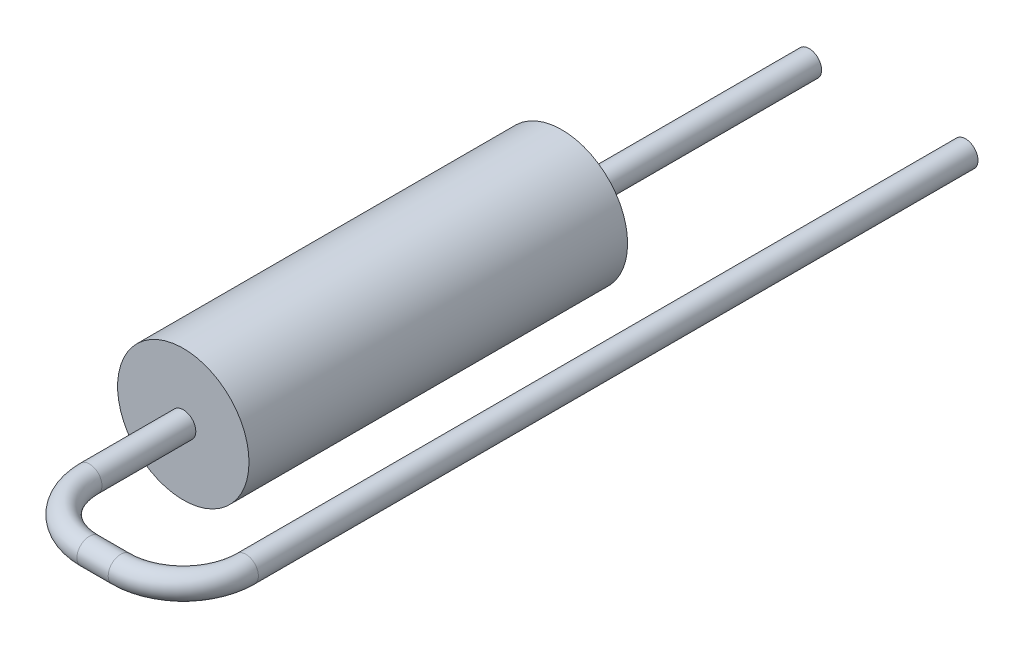
ISO-10303-21;
HEADER;
FILE_DESCRIPTION(('STEP AP214'),'2;1');
FILE_NAME('part.step','',(''),(''),'','','');
FILE_SCHEMA(('AUTOMOTIVE_DESIGN { 1 0 10303 214 1 1 1 1 }'));
ENDSEC;
DATA;
#1=APPLICATION_CONTEXT('core data for automotive mechanical design processes');
#2=APPLICATION_PROTOCOL_DEFINITION('international standard','automotive_design',2000,#1);
#3=PRODUCT_CONTEXT('',#1,'mechanical');
#4=PRODUCT('Part','Part','',(#3));
#5=PRODUCT_RELATED_PRODUCT_CATEGORY('part','',(#4));
#6=PRODUCT_DEFINITION_FORMATION('','',#4);
#7=PRODUCT_DEFINITION_CONTEXT('part definition',#1,'design');
#8=PRODUCT_DEFINITION('design','',#6,#7);
#9=PRODUCT_DEFINITION_SHAPE('','',#8);
#10=(LENGTH_UNIT() NAMED_UNIT(*) SI_UNIT(.MILLI.,.METRE.));
#11=(NAMED_UNIT(*) PLANE_ANGLE_UNIT() SI_UNIT($,.RADIAN.));
#12=(NAMED_UNIT(*) SI_UNIT($,.STERADIAN.) SOLID_ANGLE_UNIT());
#13=UNCERTAINTY_MEASURE_WITH_UNIT(LENGTH_MEASURE(1.E-05),#10,'distance_accuracy_value','');
#14=(GEOMETRIC_REPRESENTATION_CONTEXT(3) GLOBAL_UNCERTAINTY_ASSIGNED_CONTEXT((#13)) GLOBAL_UNIT_ASSIGNED_CONTEXT((#10,
#11,#12)) REPRESENTATION_CONTEXT('',''));
#15=CARTESIAN_POINT('',(0.,0.,0.));
#16=DIRECTION('',(0.,0.,1.));
#17=DIRECTION('',(1.,0.,0.));
#18=AXIS2_PLACEMENT_3D('',#15,#16,#17);
#19=CARTESIAN_POINT('',(0.,0.,0.));
#20=DIRECTION('',(0.,0.,1.));
#21=DIRECTION('',(1.,0.,0.));
#22=AXIS2_PLACEMENT_3D('',#19,#20,#21);
#23=PLANE('',#22);
#24=CARTESIAN_POINT('',(0.,0.,0.));
#25=DIRECTION('',(0.,0.,1.));
#26=DIRECTION('',(1.,0.,0.));
#27=AXIS2_PLACEMENT_3D('',#24,#25,#26);
#28=CIRCLE('',#27,2.1);
#29=CARTESIAN_POINT('',(2.1,0.,0.));
#30=VERTEX_POINT('',#29);
#31=EDGE_CURVE('E47',#30,#30,#28,.T.);
#32=ORIENTED_EDGE('',*,*,#31,.F.);
#33=EDGE_LOOP('',(#32));
#34=FACE_BOUND('',#33,.T.);
#35=CARTESIAN_POINT('',(0.,0.,0.));
#36=DIRECTION('',(0.,0.,1.));
#37=DIRECTION('',(1.,0.,0.));
#38=AXIS2_PLACEMENT_3D('',#35,#36,#37);
#39=CIRCLE('',#38,0.4);
#40=CARTESIAN_POINT('',(0.4,0.,0.));
#41=VERTEX_POINT('',#40);
#42=EDGE_CURVE('E10',#41,#41,#39,.F.);
#43=ORIENTED_EDGE('',*,*,#42,.F.);
#44=EDGE_LOOP('',(#43));
#45=FACE_BOUND('',#44,.T.);
#46=ADVANCED_FACE('F31',(#34,#45),#23,.F.);
#47=CARTESIAN_POINT('',(0.,0.,12.1));
#48=DIRECTION('',(0.,0.,-1.));
#49=DIRECTION('',(-1.,0.,0.));
#50=AXIS2_PLACEMENT_3D('',#47,#48,#49);
#51=CYLINDRICAL_SURFACE('',#50,2.1);
#52=CARTESIAN_POINT('',(0.,0.,12.1));
#53=DIRECTION('',(0.,0.,1.));
#54=DIRECTION('',(1.,0.,0.));
#55=AXIS2_PLACEMENT_3D('',#52,#53,#54);
#56=CIRCLE('',#55,2.1);
#57=CARTESIAN_POINT('',(2.1,0.,12.1));
#58=VERTEX_POINT('',#57);
#59=EDGE_CURVE('E42',#58,#58,#56,.T.);
#60=ORIENTED_EDGE('',*,*,#59,.F.);
#61=EDGE_LOOP('',(#60));
#62=FACE_BOUND('',#61,.T.);
#63=ORIENTED_EDGE('',*,*,#31,.T.);
#64=EDGE_LOOP('',(#63));
#65=FACE_BOUND('',#64,.T.);
#66=ADVANCED_FACE('F33',(#62,#65),#51,.T.);
#67=CARTESIAN_POINT('',(0.,0.,12.1));
#68=DIRECTION('',(0.,0.,1.));
#69=DIRECTION('',(1.,0.,0.));
#70=AXIS2_PLACEMENT_3D('',#67,#68,#69);
#71=PLANE('',#70);
#72=CARTESIAN_POINT('',(0.,0.,12.1));
#73=DIRECTION('',(0.,0.,1.));
#74=DIRECTION('',(1.,0.,0.));
#75=AXIS2_PLACEMENT_3D('',#72,#73,#74);
#76=CIRCLE('',#75,0.4);
#77=CARTESIAN_POINT('',(0.4,0.,12.1));
#78=VERTEX_POINT('',#77);
#79=EDGE_CURVE('E38',#78,#78,#76,.T.);
#80=ORIENTED_EDGE('',*,*,#79,.F.);
#81=EDGE_LOOP('',(#80));
#82=FACE_BOUND('',#81,.T.);
#83=ORIENTED_EDGE('',*,*,#59,.T.);
#84=EDGE_LOOP('',(#83));
#85=FACE_BOUND('',#84,.T.);
#86=ADVANCED_FACE('F73',(#82,#85),#71,.T.);
#87=CARTESIAN_POINT('',(5.,0.,15.1));
#88=DIRECTION('',(0.,0.,-1.));
#89=DIRECTION('',(-1.,0.,0.));
#90=AXIS2_PLACEMENT_3D('',#87,#88,#89);
#91=CYLINDRICAL_SURFACE('',#90,0.4);
#92=CARTESIAN_POINT('',(5.,0.,15.1));
#93=DIRECTION('',(0.,0.,-1.));
#94=DIRECTION('',(-1.,0.,0.));
#95=AXIS2_PLACEMENT_3D('',#92,#93,#94);
#96=CIRCLE('',#95,0.4);
#97=CARTESIAN_POINT('',(5.4,0.,15.1));
#98=VERTEX_POINT('',#97);
#99=EDGE_CURVE('E59',#98,#98,#96,.T.);
#100=ORIENTED_EDGE('',*,*,#99,.T.);
#101=EDGE_LOOP('',(#100));
#102=FACE_BOUND('',#101,.T.);
#103=CARTESIAN_POINT('',(5.,0.,-7.9));
#104=DIRECTION('',(0.,0.,-1.));
#105=DIRECTION('',(-1.,0.,0.));
#106=AXIS2_PLACEMENT_3D('',#103,#104,#105);
#107=CIRCLE('',#106,0.4);
#108=CARTESIAN_POINT('',(4.6,0.,-7.89999999999999));
#109=VERTEX_POINT('',#108);
#110=EDGE_CURVE('E62',#109,#109,#107,.T.);
#111=ORIENTED_EDGE('',*,*,#110,.F.);
#112=EDGE_LOOP('',(#111));
#113=FACE_BOUND('',#112,.T.);
#114=ADVANCED_FACE('F78',(#102,#113),#91,.T.);
#115=CARTESIAN_POINT('',(3.,0.,15.1));
#116=DIRECTION('',(0.,1.,0.));
#117=DIRECTION('',(0.,0.,1.));
#118=AXIS2_PLACEMENT_3D('',#115,#116,#117);
#119=TOROIDAL_SURFACE('',#118,2.,0.4);
#120=CARTESIAN_POINT('',(2.99999999999999,0.,17.1));
#121=DIRECTION('',(1.,0.,0.));
#122=DIRECTION('',(0.,0.,-1.));
#123=AXIS2_PLACEMENT_3D('',#120,#121,#122);
#124=CIRCLE('',#123,0.4);
#125=CARTESIAN_POINT('',(2.99999999999998,0.,17.5));
#126=VERTEX_POINT('',#125);
#127=EDGE_CURVE('E56',#126,#126,#124,.T.);
#128=CARTESIAN_POINT('',(3.,0.,15.1));
#129=DIRECTION('',(0.,1.,0.));
#130=DIRECTION('',(0.,0.,1.));
#131=AXIS2_PLACEMENT_3D('',#128,#129,#130);
#132=CIRCLE('',#131,2.4);
#133=EDGE_CURVE('',#126,#98,#132,.T.);
#134=ORIENTED_EDGE('',*,*,#127,.T.);
#135=ORIENTED_EDGE('',*,*,#99,.F.);
#136=ORIENTED_EDGE('',*,*,#133,.T.);
#137=ORIENTED_EDGE('',*,*,#133,.F.);
#138=EDGE_LOOP('',(#134,#136,#135,#137));
#139=FACE_BOUND('',#138,.T.);
#140=ADVANCED_FACE('F82',(#139),#119,.T.);
#141=CARTESIAN_POINT('',(2.00000000000001,0.,17.1));
#142=DIRECTION('',(1.,0.,0.));
#143=DIRECTION('',(0.,0.,-1.));
#144=AXIS2_PLACEMENT_3D('',#141,#142,#143);
#145=CYLINDRICAL_SURFACE('',#144,0.4);
#146=CARTESIAN_POINT('',(2.00000000000001,0.,17.1));
#147=DIRECTION('',(1.,0.,0.));
#148=DIRECTION('',(0.,0.,-1.));
#149=AXIS2_PLACEMENT_3D('',#146,#147,#148);
#150=CIRCLE('',#149,0.4);
#151=CARTESIAN_POINT('',(2.00000000000002,0.,17.5));
#152=VERTEX_POINT('',#151);
#153=EDGE_CURVE('E53',#152,#152,#150,.T.);
#154=ORIENTED_EDGE('',*,*,#153,.T.);
#155=EDGE_LOOP('',(#154));
#156=FACE_BOUND('',#155,.T.);
#157=ORIENTED_EDGE('',*,*,#127,.F.);
#158=EDGE_LOOP('',(#157));
#159=FACE_BOUND('',#158,.T.);
#160=ADVANCED_FACE('F86',(#156,#159),#145,.T.);
#161=CARTESIAN_POINT('',(2.,0.,15.1));
#162=DIRECTION('',(0.,1.,0.));
#163=DIRECTION('',(0.,0.,1.));
#164=AXIS2_PLACEMENT_3D('',#161,#162,#163);
#165=TOROIDAL_SURFACE('',#164,2.,0.4);
#166=CARTESIAN_POINT('',(0.,0.,15.1));
#167=DIRECTION('',(0.,0.,1.));
#168=DIRECTION('',(1.,0.,0.));
#169=AXIS2_PLACEMENT_3D('',#166,#167,#168);
#170=CIRCLE('',#169,0.4);
#171=CARTESIAN_POINT('',(-0.400000000000001,0.,15.1));
#172=VERTEX_POINT('',#171);
#173=EDGE_CURVE('E51',#172,#172,#170,.T.);
#174=CARTESIAN_POINT('',(2.,0.,15.1));
#175=DIRECTION('',(0.,1.,0.));
#176=DIRECTION('',(0.,0.,1.));
#177=AXIS2_PLACEMENT_3D('',#174,#175,#176);
#178=CIRCLE('',#177,2.4);
#179=EDGE_CURVE('',#172,#152,#178,.T.);
#180=ORIENTED_EDGE('',*,*,#173,.T.);
#181=ORIENTED_EDGE('',*,*,#153,.F.);
#182=ORIENTED_EDGE('',*,*,#179,.T.);
#183=ORIENTED_EDGE('',*,*,#179,.F.);
#184=EDGE_LOOP('',(#180,#182,#181,#183));
#185=FACE_BOUND('',#184,.T.);
#186=ADVANCED_FACE('F90',(#185),#165,.T.);
#187=CARTESIAN_POINT('',(0.,0.,15.1));
#188=DIRECTION('',(0.,0.,-1.));
#189=DIRECTION('',(-1.,0.,0.));
#190=AXIS2_PLACEMENT_3D('',#187,#188,#189);
#191=CYLINDRICAL_SURFACE('',#190,0.4);
#192=ORIENTED_EDGE('',*,*,#173,.F.);
#193=EDGE_LOOP('',(#192));
#194=FACE_BOUND('',#193,.T.);
#195=ORIENTED_EDGE('',*,*,#79,.T.);
#196=EDGE_LOOP('',(#195));
#197=FACE_BOUND('',#196,.T.);
#198=ADVANCED_FACE('F94',(#194,#197),#191,.T.);
#199=CARTESIAN_POINT('',(5.,0.,-7.9));
#200=DIRECTION('',(0.,0.,-1.));
#201=DIRECTION('',(-1.,0.,0.));
#202=AXIS2_PLACEMENT_3D('',#199,#200,#201);
#203=PLANE('',#202);
#204=ORIENTED_EDGE('',*,*,#110,.T.);
#205=EDGE_LOOP('',(#204));
#206=FACE_BOUND('',#205,.T.);
#207=ADVANCED_FACE('F98',(#206),#203,.T.);
#208=CARTESIAN_POINT('',(0.,0.,-9.03137084989833));
#209=DIRECTION('',(0.,0.,1.));
#210=DIRECTION('',(1.,0.,0.));
#211=AXIS2_PLACEMENT_3D('',#208,#209,#210);
#212=CYLINDRICAL_SURFACE('',#211,0.4);
#213=ORIENTED_EDGE('',*,*,#42,.T.);
#214=EDGE_LOOP('',(#213));
#215=FACE_BOUND('',#214,.T.);
#216=CARTESIAN_POINT('',(0.,0.,-7.89999999999986));
#217=DIRECTION('',(0.,0.,-1.));
#218=DIRECTION('',(-1.,0.,0.));
#219=AXIS2_PLACEMENT_3D('',#216,#217,#218);
#220=CIRCLE('',#219,0.4);
#221=CARTESIAN_POINT('',(-0.4,0.,-7.89999999999985));
#222=VERTEX_POINT('',#221);
#223=EDGE_CURVE('E114',#222,#222,#220,.T.);
#224=ORIENTED_EDGE('',*,*,#223,.F.);
#225=EDGE_LOOP('',(#224));
#226=FACE_BOUND('',#225,.T.);
#227=ADVANCED_FACE('F102',(#215,#226),#212,.T.);
#228=CARTESIAN_POINT('',(5.,0.,-7.9));
#229=DIRECTION('',(0.,0.,-1.));
#230=DIRECTION('',(-1.,0.,0.));
#231=AXIS2_PLACEMENT_3D('',#228,#229,#230);
#232=PLANE('',#231);
#233=ORIENTED_EDGE('',*,*,#223,.T.);
#234=EDGE_LOOP('',(#233));
#235=FACE_BOUND('',#234,.T.);
#236=ADVANCED_FACE('F104',(#235),#232,.T.);
#237=CLOSED_SHELL('',(#46,#66,#86,#114,#140,#160,#186,#198,#207,#227,#236));
#238=MANIFOLD_SOLID_BREP('B2',#237);
#239=ADVANCED_BREP_SHAPE_REPRESENTATION('',(#18,#238),#14);
#240=SHAPE_DEFINITION_REPRESENTATION(#9,#239);
ENDSEC;
END-ISO-10303-21;
